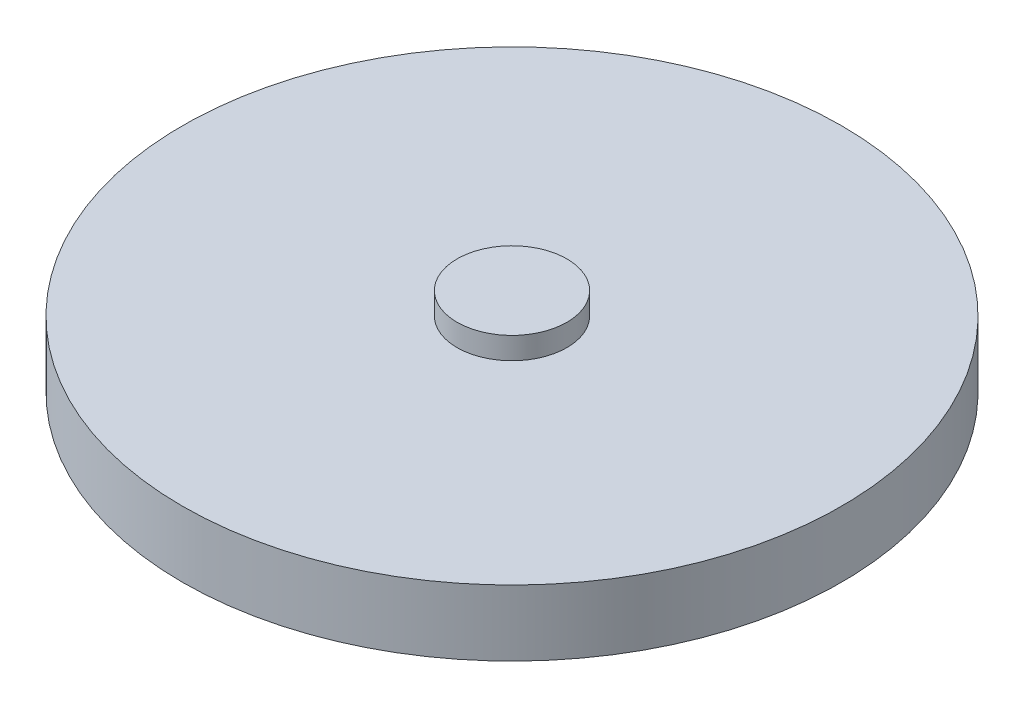
ISO-10303-21;
HEADER;
FILE_DESCRIPTION(('STEP AP214'),'2;1');
FILE_NAME('part.step','',(''),(''),'','','');
FILE_SCHEMA(('AUTOMOTIVE_DESIGN { 1 0 10303 214 1 1 1 1 }'));
ENDSEC;
DATA;
#1=APPLICATION_CONTEXT('core data for automotive mechanical design processes');
#2=APPLICATION_PROTOCOL_DEFINITION('international standard','automotive_design',2000,#1);
#3=PRODUCT_CONTEXT('',#1,'mechanical');
#4=PRODUCT('Part','Part','',(#3));
#5=PRODUCT_RELATED_PRODUCT_CATEGORY('part','',(#4));
#6=PRODUCT_DEFINITION_FORMATION('','',#4);
#7=PRODUCT_DEFINITION_CONTEXT('part definition',#1,'design');
#8=PRODUCT_DEFINITION('design','',#6,#7);
#9=PRODUCT_DEFINITION_SHAPE('','',#8);
#10=(LENGTH_UNIT() NAMED_UNIT(*) SI_UNIT(.MILLI.,.METRE.));
#11=(NAMED_UNIT(*) PLANE_ANGLE_UNIT() SI_UNIT($,.RADIAN.));
#12=(NAMED_UNIT(*) SI_UNIT($,.STERADIAN.) SOLID_ANGLE_UNIT());
#13=UNCERTAINTY_MEASURE_WITH_UNIT(LENGTH_MEASURE(1.E-05),#10,'distance_accuracy_value','');
#14=(GEOMETRIC_REPRESENTATION_CONTEXT(3) GLOBAL_UNCERTAINTY_ASSIGNED_CONTEXT((#13)) GLOBAL_UNIT_ASSIGNED_CONTEXT((#10,
#11,#12)) REPRESENTATION_CONTEXT('',''));
#15=CARTESIAN_POINT('',(0.,0.,0.));
#16=DIRECTION('',(0.,0.,1.));
#17=DIRECTION('',(1.,0.,0.));
#18=AXIS2_PLACEMENT_3D('',#15,#16,#17);
#19=CARTESIAN_POINT('',(0.,30.,0.));
#20=DIRECTION('',(0.,-1.,0.));
#21=DIRECTION('',(0.,0.,-1.));
#22=AXIS2_PLACEMENT_3D('',#19,#20,#21);
#23=CYLINDRICAL_SURFACE('',#22,150.);
#24=CARTESIAN_POINT('',(0.,30.,0.));
#25=DIRECTION('',(0.,1.,0.));
#26=DIRECTION('',(0.,0.,1.));
#27=AXIS2_PLACEMENT_3D('',#24,#25,#26);
#28=CIRCLE('',#27,150.);
#29=CARTESIAN_POINT('',(0.,30.,150.));
#30=VERTEX_POINT('',#29);
#31=EDGE_CURVE('E49',#30,#30,#28,.T.);
#32=ORIENTED_EDGE('',*,*,#31,.F.);
#33=EDGE_LOOP('',(#32));
#34=FACE_BOUND('',#33,.T.);
#35=CARTESIAN_POINT('',(0.,0.,0.));
#36=DIRECTION('',(0.,1.,0.));
#37=DIRECTION('',(0.,0.,1.));
#38=AXIS2_PLACEMENT_3D('',#35,#36,#37);
#39=CIRCLE('',#38,150.);
#40=CARTESIAN_POINT('',(0.,0.,150.));
#41=VERTEX_POINT('',#40);
#42=EDGE_CURVE('E44',#41,#41,#39,.T.);
#43=ORIENTED_EDGE('',*,*,#42,.T.);
#44=EDGE_LOOP('',(#43));
#45=FACE_BOUND('',#44,.T.);
#46=ADVANCED_FACE('F41',(#34,#45),#23,.T.);
#47=CARTESIAN_POINT('',(0.,30.,0.));
#48=DIRECTION('',(0.,1.,0.));
#49=DIRECTION('',(0.,0.,1.));
#50=AXIS2_PLACEMENT_3D('',#47,#48,#49);
#51=PLANE('',#50);
#52=CARTESIAN_POINT('',(0.,30.,0.));
#53=DIRECTION('',(0.,1.,0.));
#54=DIRECTION('',(0.,0.,1.));
#55=AXIS2_PLACEMENT_3D('',#52,#53,#54);
#56=CIRCLE('',#55,25.);
#57=CARTESIAN_POINT('',(0.,30.,25.));
#58=VERTEX_POINT('',#57);
#59=EDGE_CURVE('E10',#58,#58,#56,.T.);
#60=ORIENTED_EDGE('',*,*,#59,.F.);
#61=EDGE_LOOP('',(#60));
#62=FACE_BOUND('',#61,.T.);
#63=ORIENTED_EDGE('',*,*,#31,.T.);
#64=EDGE_LOOP('',(#63));
#65=FACE_BOUND('',#64,.T.);
#66=ADVANCED_FACE('F82',(#62,#65),#51,.T.);
#67=CARTESIAN_POINT('',(0.,0.,0.));
#68=DIRECTION('',(0.,1.,0.));
#69=DIRECTION('',(0.,0.,1.));
#70=AXIS2_PLACEMENT_3D('',#67,#68,#69);
#71=PLANE('',#70);
#72=CARTESIAN_POINT('',(0.,0.,0.));
#73=DIRECTION('',(0.,-1.,0.));
#74=DIRECTION('',(0.,0.,-1.));
#75=AXIS2_PLACEMENT_3D('',#72,#73,#74);
#76=CIRCLE('',#75,17.5);
#77=CARTESIAN_POINT('',(0.,0.,-17.5));
#78=VERTEX_POINT('',#77);
#79=EDGE_CURVE('E61',#78,#78,#76,.T.);
#80=ORIENTED_EDGE('',*,*,#79,.F.);
#81=EDGE_LOOP('',(#80));
#82=FACE_BOUND('',#81,.T.);
#83=ORIENTED_EDGE('',*,*,#42,.F.);
#84=EDGE_LOOP('',(#83));
#85=FACE_BOUND('',#84,.T.);
#86=ADVANCED_FACE('F78',(#82,#85),#71,.F.);
#87=CARTESIAN_POINT('',(0.,40.,0.));
#88=DIRECTION('',(0.,-1.,0.));
#89=DIRECTION('',(0.,0.,-1.));
#90=AXIS2_PLACEMENT_3D('',#87,#88,#89);
#91=CYLINDRICAL_SURFACE('',#90,25.);
#92=CARTESIAN_POINT('',(0.,40.,0.));
#93=DIRECTION('',(0.,1.,0.));
#94=DIRECTION('',(0.,0.,1.));
#95=AXIS2_PLACEMENT_3D('',#92,#93,#94);
#96=CIRCLE('',#95,25.);
#97=CARTESIAN_POINT('',(0.,40.,25.));
#98=VERTEX_POINT('',#97);
#99=EDGE_CURVE('E56',#98,#98,#96,.T.);
#100=ORIENTED_EDGE('',*,*,#99,.F.);
#101=EDGE_LOOP('',(#100));
#102=FACE_BOUND('',#101,.T.);
#103=ORIENTED_EDGE('',*,*,#59,.T.);
#104=EDGE_LOOP('',(#103));
#105=FACE_BOUND('',#104,.T.);
#106=ADVANCED_FACE('F81',(#102,#105),#91,.T.);
#107=CARTESIAN_POINT('',(0.,40.,0.));
#108=DIRECTION('',(0.,1.,0.));
#109=DIRECTION('',(0.,0.,1.));
#110=AXIS2_PLACEMENT_3D('',#107,#108,#109);
#111=PLANE('',#110);
#112=ORIENTED_EDGE('',*,*,#99,.T.);
#113=EDGE_LOOP('',(#112));
#114=FACE_BOUND('',#113,.T.);
#115=ADVANCED_FACE('F74',(#114),#111,.T.);
#116=CARTESIAN_POINT('',(0.,3.,0.));
#117=DIRECTION('',(0.,-1.,0.));
#118=DIRECTION('',(0.,0.,-1.));
#119=AXIS2_PLACEMENT_3D('',#116,#117,#118);
#120=CYLINDRICAL_SURFACE('',#119,17.5);
#121=CARTESIAN_POINT('',(0.,3.,0.));
#122=DIRECTION('',(0.,-1.,0.));
#123=DIRECTION('',(0.,0.,-1.));
#124=AXIS2_PLACEMENT_3D('',#121,#122,#123);
#125=CIRCLE('',#124,17.5);
#126=CARTESIAN_POINT('',(0.,3.,-17.5));
#127=VERTEX_POINT('',#126);
#128=EDGE_CURVE('E60',#127,#127,#125,.T.);
#129=ORIENTED_EDGE('',*,*,#128,.F.);
#130=EDGE_LOOP('',(#129));
#131=FACE_BOUND('',#130,.T.);
#132=ORIENTED_EDGE('',*,*,#79,.T.);
#133=EDGE_LOOP('',(#132));
#134=FACE_BOUND('',#133,.T.);
#135=ADVANCED_FACE('F71',(#131,#134),#120,.F.);
#136=CARTESIAN_POINT('',(0.,3.,0.));
#137=DIRECTION('',(0.,-1.,0.));
#138=DIRECTION('',(0.,0.,-1.));
#139=AXIS2_PLACEMENT_3D('',#136,#137,#138);
#140=PLANE('',#139);
#141=ORIENTED_EDGE('',*,*,#128,.T.);
#142=EDGE_LOOP('',(#141));
#143=FACE_BOUND('',#142,.T.);
#144=ADVANCED_FACE('F69',(#143),#140,.T.);
#145=CLOSED_SHELL('',(#46,#66,#86,#106,#115,#135,#144));
#146=MANIFOLD_SOLID_BREP('B2',#145);
#147=ADVANCED_BREP_SHAPE_REPRESENTATION('',(#18,#146),#14);
#148=SHAPE_DEFINITION_REPRESENTATION(#9,#147);
ENDSEC;
END-ISO-10303-21;
